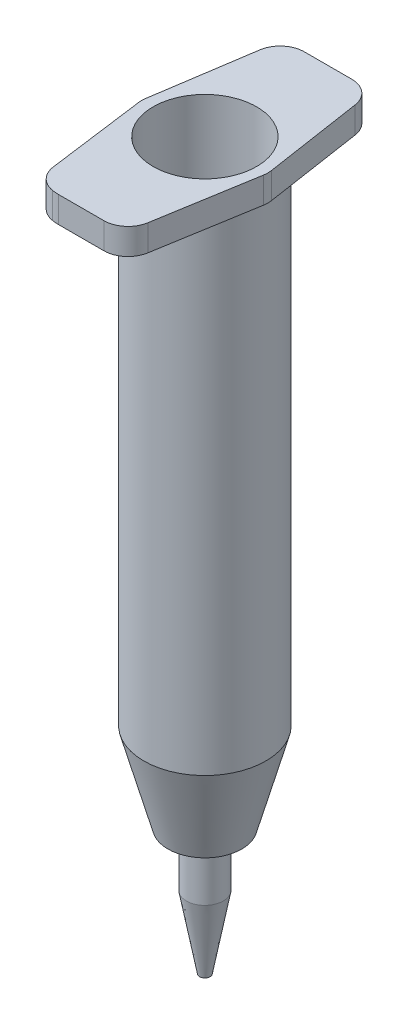
ISO-10303-21;
HEADER;
FILE_DESCRIPTION(('STEP AP214'),'2;1');
FILE_NAME('part.step','',(''),(''),'','','');
FILE_SCHEMA(('AUTOMOTIVE_DESIGN { 1 0 10303 214 1 1 1 1 }'));
ENDSEC;
DATA;
#1=APPLICATION_CONTEXT('core data for automotive mechanical design processes');
#2=APPLICATION_PROTOCOL_DEFINITION('international standard','automotive_design',2000,#1);
#3=PRODUCT_CONTEXT('',#1,'mechanical');
#4=PRODUCT('Part','Part','',(#3));
#5=PRODUCT_RELATED_PRODUCT_CATEGORY('part','',(#4));
#6=PRODUCT_DEFINITION_FORMATION('','',#4);
#7=PRODUCT_DEFINITION_CONTEXT('part definition',#1,'design');
#8=PRODUCT_DEFINITION('design','',#6,#7);
#9=PRODUCT_DEFINITION_SHAPE('','',#8);
#10=(LENGTH_UNIT() NAMED_UNIT(*) SI_UNIT(.MILLI.,.METRE.));
#11=(NAMED_UNIT(*) PLANE_ANGLE_UNIT() SI_UNIT($,.RADIAN.));
#12=(NAMED_UNIT(*) SI_UNIT($,.STERADIAN.) SOLID_ANGLE_UNIT());
#13=UNCERTAINTY_MEASURE_WITH_UNIT(LENGTH_MEASURE(1.E-05),#10,'distance_accuracy_value','');
#14=(GEOMETRIC_REPRESENTATION_CONTEXT(3) GLOBAL_UNCERTAINTY_ASSIGNED_CONTEXT((#13)) GLOBAL_UNIT_ASSIGNED_CONTEXT((#10,
#11,#12)) REPRESENTATION_CONTEXT('',''));
#15=CARTESIAN_POINT('',(0.,0.,0.));
#16=DIRECTION('',(0.,0.,1.));
#17=DIRECTION('',(1.,0.,0.));
#18=AXIS2_PLACEMENT_3D('',#15,#16,#17);
#19=CARTESIAN_POINT('',(0.,1.,0.));
#20=DIRECTION('',(0.,-1.,0.));
#21=DIRECTION('',(0.,0.,-1.));
#22=AXIS2_PLACEMENT_3D('',#19,#20,#21);
#23=PLANE('',#22);
#24=CARTESIAN_POINT('',(0.,1.,0.));
#25=DIRECTION('',(0.,-1.,0.));
#26=DIRECTION('',(0.,0.,-1.));
#27=AXIS2_PLACEMENT_3D('',#24,#25,#26);
#28=CIRCLE('',#27,3.6);
#29=CARTESIAN_POINT('',(3.13402100081113,1.,1.77141535684739));
#30=VERTEX_POINT('',#29);
#31=EDGE_CURVE('E415',#30,#30,#28,.T.);
#32=ORIENTED_EDGE('',*,*,#31,.F.);
#33=EDGE_LOOP('',(#32));
#34=FACE_BOUND('',#33,.T.);
#35=CARTESIAN_POINT('',(0.,1.,0.));
#36=DIRECTION('',(0.,1.,0.));
#37=DIRECTION('',(0.,0.,1.));
#38=AXIS2_PLACEMENT_3D('',#35,#36,#37);
#39=CIRCLE('',#38,1.27);
#40=CARTESIAN_POINT('',(0.104415360248278,1.,-1.26570037234103));
#41=VERTEX_POINT('',#40);
#42=EDGE_CURVE('E583',#41,#41,#39,.T.);
#43=ORIENTED_EDGE('',*,*,#42,.F.);
#44=EDGE_LOOP('',(#43));
#45=FACE_BOUND('',#44,.T.);
#46=ADVANCED_FACE('F43',(#34,#45),#23,.F.);
#47=CARTESIAN_POINT('',(0.,74.55,0.));
#48=DIRECTION('',(0.,-1.,0.));
#49=DIRECTION('',(0.,0.,-1.));
#50=AXIS2_PLACEMENT_3D('',#47,#48,#49);
#51=PLANE('',#50);
#52=CARTESIAN_POINT('',(0.,74.55,0.));
#53=DIRECTION('',(0.,1.,0.));
#54=DIRECTION('',(0.,0.,1.));
#55=AXIS2_PLACEMENT_3D('',#52,#53,#54);
#56=CIRCLE('',#55,6.45);
#57=CARTESIAN_POINT('',(0.,74.55,6.45));
#58=VERTEX_POINT('',#57);
#59=EDGE_CURVE('E186',#58,#58,#56,.T.);
#60=ORIENTED_EDGE('',*,*,#59,.F.);
#61=EDGE_LOOP('',(#60));
#62=FACE_BOUND('',#61,.T.);
#63=DIRECTION('',(0.164427381847979,0.,-0.986389190988334));
#64=VECTOR('',#63,1.);
#65=CARTESIAN_POINT('',(7.66208863427662,74.55,1.2772414632392));
#66=LINE('',#65,#64);
#67=CARTESIAN_POINT('',(5.73407299388516,74.55,12.8432821455439));
#68=VERTEX_POINT('',#67);
#69=CARTESIAN_POINT('',(7.79635098347913,74.55,0.471810345127156));
#70=VERTEX_POINT('',#69);
#71=EDGE_CURVE('E442',#68,#70,#66,.T.);
#72=ORIENTED_EDGE('',*,*,#71,.T.);
#73=CARTESIAN_POINT('',(4.83718341051413,74.55,-0.0214718004167819));
#74=DIRECTION('',(0.,-1.,0.));
#75=DIRECTION('',(0.,0.,-1.));
#76=AXIS2_PLACEMENT_3D('',#73,#74,#75);
#77=CIRCLE('',#76,3.);
#78=CARTESIAN_POINT('',(7.80302817866241,74.55,-0.472874958632888));
#79=VERTEX_POINT('',#78);
#80=EDGE_CURVE('E256',#70,#79,#77,.F.);
#81=ORIENTED_EDGE('',*,*,#80,.T.);
#82=DIRECTION('',(0.150467719405369,0.,0.988614922716093));
#83=VECTOR('',#82,1.);
#84=CARTESIAN_POINT('',(7.69670579015846,74.55,-1.17144273323074));
#85=LINE('',#84,#83);
#86=CARTESIAN_POINT('',(5.92690152105113,74.55,-12.7995508592832));
#87=VERTEX_POINT('',#86);
#88=EDGE_CURVE('E434',#87,#79,#85,.T.);
#89=ORIENTED_EDGE('',*,*,#88,.F.);
#90=CARTESIAN_POINT('',(2.96105675290285,74.55,-12.3481477010671));
#91=DIRECTION('',(0.,-1.,0.));
#92=DIRECTION('',(0.,0.,-1.));
#93=AXIS2_PLACEMENT_3D('',#90,#91,#92);
#94=CIRCLE('',#93,3.);
#95=CARTESIAN_POINT('',(3.09014188225713,74.55,-15.3453692526678));
#96=VERTEX_POINT('',#95);
#97=EDGE_CURVE('E241',#87,#96,#94,.F.);
#98=ORIENTED_EDGE('',*,*,#97,.T.);
#99=CARTESIAN_POINT('',(2.875,74.55,-10.35));
#100=DIRECTION('',(0.,-1.,0.));
#101=DIRECTION('',(0.,0.,-1.));
#102=AXIS2_PLACEMENT_3D('',#99,#100,#101);
#103=CIRCLE('',#102,5.);
#104=CARTESIAN_POINT('',(2.875,74.55,-15.35));
#105=VERTEX_POINT('',#104);
#106=EDGE_CURVE('E160',#96,#105,#103,.F.);
#107=ORIENTED_EDGE('',*,*,#106,.T.);
#108=DIRECTION('',(-1.,0.,0.));
#109=VECTOR('',#108,1.);
#110=CARTESIAN_POINT('',(7.875,74.55,-15.35));
#111=LINE('',#110,#109);
#112=CARTESIAN_POINT('',(-2.875,74.55,-15.35));
#113=VERTEX_POINT('',#112);
#114=EDGE_CURVE('E178',#105,#113,#111,.T.);
#115=ORIENTED_EDGE('',*,*,#114,.T.);
#116=CARTESIAN_POINT('',(-2.875,74.55,-10.35));
#117=DIRECTION('',(0.,-1.,0.));
#118=DIRECTION('',(0.,0.,-1.));
#119=AXIS2_PLACEMENT_3D('',#116,#117,#118);
#120=CIRCLE('',#119,5.);
#121=CARTESIAN_POINT('',(-3.11575123219801,74.55,-15.3442005210239));
#122=VERTEX_POINT('',#121);
#123=EDGE_CURVE('E220',#113,#122,#120,.F.);
#124=ORIENTED_EDGE('',*,*,#123,.T.);
#125=CARTESIAN_POINT('',(-2.9713004928792,74.55,-12.3476802084095));
#126=DIRECTION('',(0.,-1.,0.));
#127=DIRECTION('',(0.,0.,-1.));
#128=AXIS2_PLACEMENT_3D('',#125,#126,#127);
#129=CIRCLE('',#128,3.);
#130=CARTESIAN_POINT('',(-5.93749508686239,74.55,-12.7967788953648));
#131=VERTEX_POINT('',#130);
#132=EDGE_CURVE('E250',#122,#131,#129,.F.);
#133=ORIENTED_EDGE('',*,*,#132,.T.);
#134=DIRECTION('',(-0.149699562318408,0.,0.98873153132773));
#135=VECTOR('',#134,1.);
#136=CARTESIAN_POINT('',(-7.69852157320321,74.55,-1.16559983523509));
#137=LINE('',#136,#135);
#138=CARTESIAN_POINT('',(-7.8109780399289,74.55,-0.422850472234944));
#139=VERTEX_POINT('',#138);
#140=EDGE_CURVE('E424',#131,#139,#137,.T.);
#141=ORIENTED_EDGE('',*,*,#140,.T.);
#142=CARTESIAN_POINT('',(-4.84478344594571,74.55,0.0262482147202797));
#143=DIRECTION('',(0.,-1.,0.));
#144=DIRECTION('',(0.,0.,-1.));
#145=AXIS2_PLACEMENT_3D('',#142,#143,#144);
#146=CIRCLE('',#145,3.);
#147=CARTESIAN_POINT('',(-7.81831269235019,74.55,0.423896074990171));
#148=VERTEX_POINT('',#147);
#149=EDGE_CURVE('E253',#139,#148,#146,.F.);
#150=ORIENTED_EDGE('',*,*,#149,.T.);
#151=DIRECTION('',(-0.132549286756631,0.,-0.991176415468159));
#152=VECTOR('',#151,1.);
#153=CARTESIAN_POINT('',(-7.73664165681993,74.55,1.03461534949735));
#154=LINE('',#153,#152);
#155=CARTESIAN_POINT('',(-6.1738280043085,74.55,12.7210157221006));
#156=VERTEX_POINT('',#155);
#157=EDGE_CURVE('E443',#156,#148,#154,.T.);
#158=ORIENTED_EDGE('',*,*,#157,.F.);
#159=CARTESIAN_POINT('',(-3.20029875790403,74.55,12.3233678618307));
#160=DIRECTION('',(0.,-1.,0.));
#161=DIRECTION('',(0.,0.,-1.));
#162=AXIS2_PLACEMENT_3D('',#159,#160,#161);
#163=CIRCLE('',#162,3.);
#164=CARTESIAN_POINT('',(-3.68824689476008,74.55,15.2834196545766));
#165=VERTEX_POINT('',#164);
#166=EDGE_CURVE('E247',#156,#165,#163,.F.);
#167=ORIENTED_EDGE('',*,*,#166,.T.);
#168=CARTESIAN_POINT('',(-2.875,74.55,10.35));
#169=DIRECTION('',(0.,-1.,0.));
#170=DIRECTION('',(0.,0.,-1.));
#171=AXIS2_PLACEMENT_3D('',#168,#169,#170);
#172=CIRCLE('',#171,5.);
#173=CARTESIAN_POINT('',(-2.875,74.55,15.35));
#174=VERTEX_POINT('',#173);
#175=EDGE_CURVE('E224',#165,#174,#172,.F.);
#176=ORIENTED_EDGE('',*,*,#175,.T.);
#177=DIRECTION('',(1.,0.,0.));
#178=VECTOR('',#177,1.);
#179=CARTESIAN_POINT('',(7.875,74.55,15.35));
#180=LINE('',#179,#178);
#181=CARTESIAN_POINT('',(2.77490542092016,74.55,15.35));
#182=VERTEX_POINT('',#181);
#183=EDGE_CURVE('E170',#174,#182,#180,.T.);
#184=ORIENTED_EDGE('',*,*,#183,.T.);
#185=CARTESIAN_POINT('',(2.77490542092016,74.55,12.35));
#186=DIRECTION('',(0.,-1.,0.));
#187=DIRECTION('',(0.,0.,-1.));
#188=AXIS2_PLACEMENT_3D('',#185,#186,#187);
#189=CIRCLE('',#188,3.);
#190=EDGE_CURVE('E244',#182,#68,#189,.F.);
#191=ORIENTED_EDGE('',*,*,#190,.T.);
#192=EDGE_LOOP('',(#72,#81,#89,#98,#107,#115,#124,#133,#141,#150,#158,#167,#176,#184,#191));
#193=FACE_BOUND('',#192,.T.);
#194=ADVANCED_FACE('F324',(#62,#193),#51,.F.);
#195=CARTESIAN_POINT('',(0.,71.3,0.));
#196=DIRECTION('',(0.,-1.,0.));
#197=DIRECTION('',(0.,0.,-1.));
#198=AXIS2_PLACEMENT_3D('',#195,#196,#197);
#199=PLANE('',#198);
#200=CARTESIAN_POINT('',(0.,71.3,0.));
#201=DIRECTION('',(0.,1.,0.));
#202=DIRECTION('',(0.,0.,1.));
#203=AXIS2_PLACEMENT_3D('',#200,#201,#202);
#204=CIRCLE('',#203,7.6);
#205=CARTESIAN_POINT('',(0.,71.3,7.6));
#206=VERTEX_POINT('',#205);
#207=EDGE_CURVE('E196',#206,#206,#204,.T.);
#208=ORIENTED_EDGE('',*,*,#207,.T.);
#209=EDGE_LOOP('',(#208));
#210=FACE_BOUND('',#209,.T.);
#211=DIRECTION('',(-0.150467719405369,0.,-0.988614922716093));
#212=VECTOR('',#211,1.);
#213=CARTESIAN_POINT('',(7.69670579015846,71.3,-1.17144273323074));
#214=LINE('',#213,#212);
#215=CARTESIAN_POINT('',(7.80302817866241,71.3,-0.472874958632888));
#216=VERTEX_POINT('',#215);
#217=CARTESIAN_POINT('',(5.92690152105113,71.3,-12.7995508592832));
#218=VERTEX_POINT('',#217);
#219=EDGE_CURVE('E438',#216,#218,#214,.T.);
#220=ORIENTED_EDGE('',*,*,#219,.F.);
#221=CARTESIAN_POINT('',(4.83718341051413,71.3,-0.0214718004167819));
#222=DIRECTION('',(0.,-1.,0.));
#223=DIRECTION('',(0.,0.,-1.));
#224=AXIS2_PLACEMENT_3D('',#221,#222,#223);
#225=CIRCLE('',#224,3.);
#226=CARTESIAN_POINT('',(7.79635098347913,71.3,0.471810345127156));
#227=VERTEX_POINT('',#226);
#228=EDGE_CURVE('E280',#216,#227,#225,.T.);
#229=ORIENTED_EDGE('',*,*,#228,.T.);
#230=DIRECTION('',(-0.164427381847979,0.,0.986389190988333));
#231=VECTOR('',#230,1.);
#232=CARTESIAN_POINT('',(7.66208863427662,71.3,1.2772414632392));
#233=LINE('',#232,#231);
#234=CARTESIAN_POINT('',(5.73407299388516,71.3,12.8432821455439));
#235=VERTEX_POINT('',#234);
#236=EDGE_CURVE('E447',#227,#235,#233,.T.);
#237=ORIENTED_EDGE('',*,*,#236,.T.);
#238=CARTESIAN_POINT('',(2.77490542092016,71.3,12.35));
#239=DIRECTION('',(0.,-1.,0.));
#240=DIRECTION('',(0.,0.,-1.));
#241=AXIS2_PLACEMENT_3D('',#238,#239,#240);
#242=CIRCLE('',#241,3.);
#243=CARTESIAN_POINT('',(2.77490542092016,71.3,15.35));
#244=VERTEX_POINT('',#243);
#245=EDGE_CURVE('E70',#235,#244,#242,.T.);
#246=ORIENTED_EDGE('',*,*,#245,.T.);
#247=DIRECTION('',(1.,0.,0.));
#248=VECTOR('',#247,1.);
#249=CARTESIAN_POINT('',(7.875,71.3,15.35));
#250=LINE('',#249,#248);
#251=CARTESIAN_POINT('',(-2.875,71.3,15.35));
#252=VERTEX_POINT('',#251);
#253=EDGE_CURVE('E167',#252,#244,#250,.T.);
#254=ORIENTED_EDGE('',*,*,#253,.F.);
#255=CARTESIAN_POINT('',(-2.875,71.3,10.35));
#256=DIRECTION('',(0.,-1.,0.));
#257=DIRECTION('',(0.,0.,-1.));
#258=AXIS2_PLACEMENT_3D('',#255,#256,#257);
#259=CIRCLE('',#258,5.);
#260=CARTESIAN_POINT('',(-3.68824689476008,71.3,15.2834196545766));
#261=VERTEX_POINT('',#260);
#262=EDGE_CURVE('E154',#252,#261,#259,.T.);
#263=ORIENTED_EDGE('',*,*,#262,.T.);
#264=CARTESIAN_POINT('',(-3.20029875790403,71.3,12.3233678618307));
#265=DIRECTION('',(0.,-1.,0.));
#266=DIRECTION('',(0.,0.,-1.));
#267=AXIS2_PLACEMENT_3D('',#264,#265,#266);
#268=CIRCLE('',#267,3.);
#269=CARTESIAN_POINT('',(-6.1738280043085,71.3,12.7210157221006));
#270=VERTEX_POINT('',#269);
#271=EDGE_CURVE('E271',#261,#270,#268,.T.);
#272=ORIENTED_EDGE('',*,*,#271,.T.);
#273=DIRECTION('',(0.132549286756631,0.,0.991176415468159));
#274=VECTOR('',#273,1.);
#275=CARTESIAN_POINT('',(-7.73664165681993,71.3,1.03461534949735));
#276=LINE('',#275,#274);
#277=CARTESIAN_POINT('',(-7.81831269235019,71.3,0.423896074990171));
#278=VERTEX_POINT('',#277);
#279=EDGE_CURVE('E453',#278,#270,#276,.T.);
#280=ORIENTED_EDGE('',*,*,#279,.F.);
#281=CARTESIAN_POINT('',(-4.84478344594571,71.3,0.0262482147202797));
#282=DIRECTION('',(0.,-1.,0.));
#283=DIRECTION('',(0.,0.,-1.));
#284=AXIS2_PLACEMENT_3D('',#281,#282,#283);
#285=CIRCLE('',#284,3.);
#286=CARTESIAN_POINT('',(-7.8109780399289,71.3,-0.422850472234944));
#287=VERTEX_POINT('',#286);
#288=EDGE_CURVE('E277',#278,#287,#285,.T.);
#289=ORIENTED_EDGE('',*,*,#288,.T.);
#290=DIRECTION('',(0.149699562318408,0.,-0.98873153132773));
#291=VECTOR('',#290,1.);
#292=CARTESIAN_POINT('',(-7.69852157320321,71.3,-1.16559983523509));
#293=LINE('',#292,#291);
#294=CARTESIAN_POINT('',(-5.93749508686239,71.3,-12.7967788953648));
#295=VERTEX_POINT('',#294);
#296=EDGE_CURVE('E430',#287,#295,#293,.T.);
#297=ORIENTED_EDGE('',*,*,#296,.T.);
#298=CARTESIAN_POINT('',(-2.9713004928792,71.3,-12.3476802084095));
#299=DIRECTION('',(0.,-1.,0.));
#300=DIRECTION('',(0.,0.,-1.));
#301=AXIS2_PLACEMENT_3D('',#298,#299,#300);
#302=CIRCLE('',#301,3.);
#303=CARTESIAN_POINT('',(-3.11575123219801,71.3,-15.3442005210239));
#304=VERTEX_POINT('',#303);
#305=EDGE_CURVE('E274',#295,#304,#302,.T.);
#306=ORIENTED_EDGE('',*,*,#305,.T.);
#307=CARTESIAN_POINT('',(-2.875,71.3,-10.35));
#308=DIRECTION('',(0.,-1.,0.));
#309=DIRECTION('',(0.,0.,-1.));
#310=AXIS2_PLACEMENT_3D('',#307,#308,#309);
#311=CIRCLE('',#310,5.);
#312=CARTESIAN_POINT('',(-2.875,71.3,-15.35));
#313=VERTEX_POINT('',#312);
#314=EDGE_CURVE('E161',#304,#313,#311,.T.);
#315=ORIENTED_EDGE('',*,*,#314,.T.);
#316=DIRECTION('',(-1.,0.,0.));
#317=VECTOR('',#316,1.);
#318=CARTESIAN_POINT('',(7.875,71.3,-15.35));
#319=LINE('',#318,#317);
#320=CARTESIAN_POINT('',(2.875,71.3,-15.35));
#321=VERTEX_POINT('',#320);
#322=EDGE_CURVE('E179',#321,#313,#319,.T.);
#323=ORIENTED_EDGE('',*,*,#322,.F.);
#324=CARTESIAN_POINT('',(2.875,71.3,-10.35));
#325=DIRECTION('',(0.,-1.,0.));
#326=DIRECTION('',(0.,0.,-1.));
#327=AXIS2_PLACEMENT_3D('',#324,#325,#326);
#328=CIRCLE('',#327,5.);
#329=CARTESIAN_POINT('',(3.09014188225713,71.3,-15.3453692526678));
#330=VERTEX_POINT('',#329);
#331=EDGE_CURVE('E172',#321,#330,#328,.T.);
#332=ORIENTED_EDGE('',*,*,#331,.T.);
#333=CARTESIAN_POINT('',(2.96105675290285,71.3,-12.3481477010671));
#334=DIRECTION('',(0.,-1.,0.));
#335=DIRECTION('',(0.,0.,-1.));
#336=AXIS2_PLACEMENT_3D('',#333,#334,#335);
#337=CIRCLE('',#336,3.);
#338=EDGE_CURVE('E266',#330,#218,#337,.T.);
#339=ORIENTED_EDGE('',*,*,#338,.T.);
#340=EDGE_LOOP('',(#220,#229,#237,#246,#254,#263,#272,#280,#289,#297,#306,#315,#323,#332,#339));
#341=FACE_BOUND('',#340,.T.);
#342=ADVANCED_FACE('F176',(#210,#341),#199,.T.);
#343=CARTESIAN_POINT('',(-2.875,74.55,-10.35));
#344=DIRECTION('',(0.,-1.,0.));
#345=DIRECTION('',(0.,0.,-1.));
#346=AXIS2_PLACEMENT_3D('',#343,#344,#345);
#347=CYLINDRICAL_SURFACE('',#346,5.);
#348=ORIENTED_EDGE('',*,*,#314,.F.);
#349=DIRECTION('',(0.,-1.,0.));
#350=VECTOR('',#349,1.);
#351=CARTESIAN_POINT('',(-3.11575123219801,74.55,-15.3442005210239));
#352=LINE('',#351,#350);
#353=EDGE_CURVE('E297',#304,#122,#352,.F.);
#354=ORIENTED_EDGE('',*,*,#353,.T.);
#355=ORIENTED_EDGE('',*,*,#123,.F.);
#356=DIRECTION('',(0.,-1.,0.));
#357=VECTOR('',#356,1.);
#358=CARTESIAN_POINT('',(-2.875,74.55,-15.35));
#359=LINE('',#358,#357);
#360=EDGE_CURVE('E231',#313,#113,#359,.F.);
#361=ORIENTED_EDGE('',*,*,#360,.F.);
#362=EDGE_LOOP('',(#348,#354,#355,#361));
#363=FACE_BOUND('',#362,.T.);
#364=ADVANCED_FACE('F330',(#363),#347,.T.);
#365=CARTESIAN_POINT('',(0.,71.3,0.));
#366=DIRECTION('',(0.,-1.,0.));
#367=DIRECTION('',(0.,0.,-1.));
#368=AXIS2_PLACEMENT_3D('',#365,#366,#367);
#369=CYLINDRICAL_SURFACE('',#368,7.6);
#370=CARTESIAN_POINT('',(0.,11.,0.));
#371=DIRECTION('',(0.,1.,0.));
#372=DIRECTION('',(0.,0.,1.));
#373=AXIS2_PLACEMENT_3D('',#370,#371,#372);
#374=CIRCLE('',#373,7.6);
#375=CARTESIAN_POINT('',(0.,11.,7.6));
#376=VERTEX_POINT('',#375);
#377=EDGE_CURVE('E200',#376,#376,#374,.T.);
#378=ORIENTED_EDGE('',*,*,#377,.T.);
#379=EDGE_LOOP('',(#378));
#380=FACE_BOUND('',#379,.T.);
#381=ORIENTED_EDGE('',*,*,#207,.F.);
#382=EDGE_LOOP('',(#381));
#383=FACE_BOUND('',#382,.T.);
#384=ADVANCED_FACE('F351',(#380,#383),#369,.T.);
#385=CARTESIAN_POINT('',(0.,0.,0.));
#386=DIRECTION('',(0.,1.,0.));
#387=DIRECTION('',(0.,0.,1.));
#388=AXIS2_PLACEMENT_3D('',#385,#386,#387);
#389=PLANE('',#388);
#390=CARTESIAN_POINT('',(0.,0.,0.));
#391=DIRECTION('',(0.,-1.,0.));
#392=DIRECTION('',(0.,0.,-1.));
#393=AXIS2_PLACEMENT_3D('',#390,#391,#392);
#394=CIRCLE('',#393,2.3);
#395=CARTESIAN_POINT('',(0.,0.,-2.3));
#396=VERTEX_POINT('',#395);
#397=EDGE_CURVE('E190',#396,#396,#394,.T.);
#398=ORIENTED_EDGE('',*,*,#397,.F.);
#399=EDGE_LOOP('',(#398));
#400=FACE_BOUND('',#399,.T.);
#401=CARTESIAN_POINT('',(0.,0.,0.));
#402=DIRECTION('',(0.,1.,0.));
#403=DIRECTION('',(0.,0.,1.));
#404=AXIS2_PLACEMENT_3D('',#401,#402,#403);
#405=CIRCLE('',#404,4.60000000000004);
#406=CARTESIAN_POINT('',(0.,0.,4.60000000000004));
#407=VERTEX_POINT('',#406);
#408=EDGE_CURVE('E195',#407,#407,#405,.F.);
#409=ORIENTED_EDGE('',*,*,#408,.T.);
#410=EDGE_LOOP('',(#409));
#411=FACE_BOUND('',#410,.T.);
#412=ADVANCED_FACE('F348',(#400,#411),#389,.F.);
#413=CARTESIAN_POINT('',(0.,11.,0.));
#414=DIRECTION('',(0.,1.,0.));
#415=DIRECTION('',(0.,0.,1.));
#416=AXIS2_PLACEMENT_3D('',#413,#414,#415);
#417=CONICAL_SURFACE('',#416,7.6,0.266252049150922);
#418=ORIENTED_EDGE('',*,*,#408,.F.);
#419=EDGE_LOOP('',(#418));
#420=FACE_BOUND('',#419,.T.);
#421=ORIENTED_EDGE('',*,*,#377,.F.);
#422=EDGE_LOOP('',(#421));
#423=FACE_BOUND('',#422,.T.);
#424=ADVANCED_FACE('F346',(#420,#423),#417,.T.);
#425=CARTESIAN_POINT('',(0.,-15.75,0.));
#426=DIRECTION('',(0.,1.,0.));
#427=DIRECTION('',(0.,0.,1.));
#428=AXIS2_PLACEMENT_3D('',#425,#426,#427);
#429=CYLINDRICAL_SURFACE('',#428,2.3);
#430=CARTESIAN_POINT('',(0.,-6.74999999999979,0.));
#431=DIRECTION('',(0.,-1.,0.));
#432=DIRECTION('',(0.,0.,-1.));
#433=AXIS2_PLACEMENT_3D('',#430,#431,#432);
#434=CIRCLE('',#433,2.3);
#435=CARTESIAN_POINT('',(0.,-6.74999999999979,2.3));
#436=VERTEX_POINT('',#435);
#437=EDGE_CURVE('E173',#436,#436,#434,.F.);
#438=ORIENTED_EDGE('',*,*,#437,.T.);
#439=EDGE_LOOP('',(#438));
#440=FACE_BOUND('',#439,.T.);
#441=ORIENTED_EDGE('',*,*,#397,.T.);
#442=EDGE_LOOP('',(#441));
#443=FACE_BOUND('',#442,.T.);
#444=ADVANCED_FACE('F342',(#440,#443),#429,.T.);
#445=CARTESIAN_POINT('',(0.,-15.75,0.));
#446=DIRECTION('',(0.,-1.,0.));
#447=DIRECTION('',(0.,0.,-1.));
#448=AXIS2_PLACEMENT_3D('',#445,#446,#447);
#449=PLANE('',#448);
#450=CARTESIAN_POINT('',(0.,-15.75,0.));
#451=DIRECTION('',(0.,-1.,0.));
#452=DIRECTION('',(0.,0.,-1.));
#453=AXIS2_PLACEMENT_3D('',#450,#451,#452);
#454=CIRCLE('',#453,0.25);
#455=CARTESIAN_POINT('',(0.160322235702025,-15.75,-0.191824869971296));
#456=VERTEX_POINT('',#455);
#457=EDGE_CURVE('E580',#456,#456,#454,.T.);
#458=ORIENTED_EDGE('',*,*,#457,.F.);
#459=EDGE_LOOP('',(#458));
#460=FACE_BOUND('',#459,.T.);
#461=CARTESIAN_POINT('',(0.,-15.75,0.));
#462=DIRECTION('',(0.,-1.,0.));
#463=DIRECTION('',(0.,0.,-1.));
#464=AXIS2_PLACEMENT_3D('',#461,#462,#463);
#465=CIRCLE('',#464,0.649999999999991);
#466=CARTESIAN_POINT('',(0.,-15.75,0.649999999999991));
#467=VERTEX_POINT('',#466);
#468=EDGE_CURVE('E194',#467,#467,#465,.T.);
#469=ORIENTED_EDGE('',*,*,#468,.T.);
#470=EDGE_LOOP('',(#469));
#471=FACE_BOUND('',#470,.T.);
#472=ADVANCED_FACE('F339',(#460,#471),#449,.T.);
#473=CARTESIAN_POINT('',(0.,-15.75,0.));
#474=DIRECTION('',(0.,1.,0.));
#475=DIRECTION('',(0.,0.,1.));
#476=AXIS2_PLACEMENT_3D('',#473,#474,#475);
#477=CONICAL_SURFACE('',#476,0.649999999999991,0.181319774401487);
#478=CARTESIAN_POINT('',(0.,-6.74999999999979,2.3));
#479=CARTESIAN_POINT('',(0.,-6.84374999999979,2.2828125));
#480=CARTESIAN_POINT('',(0.,-6.93749999999979,2.265625));
#481=CARTESIAN_POINT('',(0.,-7.1249999999998,2.23125));
#482=CARTESIAN_POINT('',(0.,-7.2187499999998,2.2140625));
#483=CARTESIAN_POINT('',(0.,-7.4062499999998,2.1796875));
#484=CARTESIAN_POINT('',(0.,-7.4999999999998,2.1625));
#485=CARTESIAN_POINT('',(0.,-7.68749999999981,2.128125));
#486=CARTESIAN_POINT('',(0.,-7.78124999999981,2.1109375));
#487=CARTESIAN_POINT('',(0.,-7.96874999999982,2.0765625));
#488=CARTESIAN_POINT('',(0.,-8.06249999999982,2.059375));
#489=CARTESIAN_POINT('',(0.,-8.24999999999982,2.025));
#490=CARTESIAN_POINT('',(0.,-8.34374999999983,2.0078125));
#491=CARTESIAN_POINT('',(0.,-8.53124999999983,1.9734375));
#492=CARTESIAN_POINT('',(0.,-8.62499999999983,1.95625));
#493=CARTESIAN_POINT('',(0.,-8.81249999999984,1.921875));
#494=CARTESIAN_POINT('',(0.,-8.90624999999984,1.9046875));
#495=CARTESIAN_POINT('',(0.,-9.09374999999984,1.8703125));
#496=CARTESIAN_POINT('',(0.,-9.18749999999985,1.853125));
#497=CARTESIAN_POINT('',(0.,-9.37499999999985,1.81875));
#498=CARTESIAN_POINT('',(0.,-9.46874999999985,1.8015625));
#499=CARTESIAN_POINT('',(0.,-9.65624999999985,1.7671875));
#500=CARTESIAN_POINT('',(0.,-9.74999999999986,1.75));
#501=CARTESIAN_POINT('',(0.,-9.93749999999986,1.715625));
#502=CARTESIAN_POINT('',(0.,-10.0312499999999,1.6984375));
#503=CARTESIAN_POINT('',(0.,-10.2187499999999,1.6640625));
#504=CARTESIAN_POINT('',(0.,-10.3124999999999,1.646875));
#505=CARTESIAN_POINT('',(0.,-10.4999999999999,1.6125));
#506=CARTESIAN_POINT('',(0.,-10.5937499999999,1.5953125));
#507=CARTESIAN_POINT('',(0.,-10.7812499999999,1.5609375));
#508=CARTESIAN_POINT('',(0.,-10.8749999999999,1.54375));
#509=CARTESIAN_POINT('',(0.,-11.0624999999999,1.509375));
#510=CARTESIAN_POINT('',(0.,-11.1562499999999,1.4921875));
#511=CARTESIAN_POINT('',(0.,-11.3437499999999,1.4578125));
#512=CARTESIAN_POINT('',(0.,-11.4374999999999,1.440625));
#513=CARTESIAN_POINT('',(0.,-11.6249999999999,1.40625));
#514=CARTESIAN_POINT('',(0.,-11.7187499999999,1.38906249999999));
#515=CARTESIAN_POINT('',(0.,-11.9062499999999,1.35468749999999));
#516=CARTESIAN_POINT('',(0.,-11.9999999999999,1.33749999999999));
#517=CARTESIAN_POINT('',(0.,-12.1874999999999,1.30312499999999));
#518=CARTESIAN_POINT('',(0.,-12.2812499999999,1.28593749999999));
#519=CARTESIAN_POINT('',(0.,-12.4687499999999,1.25156249999999));
#520=CARTESIAN_POINT('',(0.,-12.5624999999999,1.23437499999999));
#521=CARTESIAN_POINT('',(0.,-12.7499999999999,1.19999999999999));
#522=CARTESIAN_POINT('',(0.,-12.8437499999999,1.18281249999999));
#523=CARTESIAN_POINT('',(0.,-13.0312499999999,1.14843749999999));
#524=CARTESIAN_POINT('',(0.,-13.1249999999999,1.13124999999999));
#525=CARTESIAN_POINT('',(0.,-13.3124999999999,1.09687499999999));
#526=CARTESIAN_POINT('',(0.,-13.4062499999999,1.07968749999999));
#527=CARTESIAN_POINT('',(0.,-13.5937499999999,1.04531249999999));
#528=CARTESIAN_POINT('',(0.,-13.6875,1.02812499999999));
#529=CARTESIAN_POINT('',(0.,-13.875,0.993749999999993));
#530=CARTESIAN_POINT('',(0.,-13.96875,0.976562499999993));
#531=CARTESIAN_POINT('',(0.,-14.15625,0.942187499999993));
#532=CARTESIAN_POINT('',(0.,-14.25,0.924999999999993));
#533=CARTESIAN_POINT('',(0.,-14.4375,0.890624999999993));
#534=CARTESIAN_POINT('',(0.,-14.53125,0.873437499999993));
#535=CARTESIAN_POINT('',(0.,-14.71875,0.839062499999992));
#536=CARTESIAN_POINT('',(0.,-14.8125,0.821874999999992));
#537=CARTESIAN_POINT('',(0.,-15.,0.787499999999992));
#538=CARTESIAN_POINT('',(0.,-15.09375,0.770312499999992));
#539=CARTESIAN_POINT('',(0.,-15.28125,0.735937499999992));
#540=CARTESIAN_POINT('',(0.,-15.375,0.718749999999992));
#541=CARTESIAN_POINT('',(0.,-15.5625,0.684374999999991));
#542=CARTESIAN_POINT('',(0.,-15.65625,0.667187499999991));
#543=CARTESIAN_POINT('',(0.,-15.75,0.649999999999991));
#544=B_SPLINE_CURVE_WITH_KNOTS('',3,(#478,#479,#480,#481,#482,#483,#484,#485,#486,#487,#488,
#489,#490,#491,#492,#493,#494,#495,#496,#497,#498,#499,#500,#501,#502,#503,#504,#505,#506,#507,
#508,#509,#510,#511,#512,#513,#514,#515,#516,#517,#518,#519,#520,#521,#522,#523,#524,#525,#526,
#527,#528,#529,#530,#531,#532,#533,#534,#535,#536,#537,#538,#539,#540,#541,#542,#543),
.UNSPECIFIED.,.F.,.F.,(4,2,2,2,2,2,2,2,2,2,2,2,2,2,2,2,2,2,2,2,2,2,2,2,2,2,2,2,2,2,2,2,4),(0.,
0.285937500000007,0.571875000000013,0.85781250000002,1.14375000000003,1.42968750000003,
1.71562500000004,2.00156250000005,2.28750000000005,2.57343750000006,2.85937500000006,
3.14531250000007,3.43125000000008,3.71718750000009,4.00312500000009,4.2890625000001,
4.5750000000001,4.86093750000011,5.14687500000012,5.43281250000013,5.71875000000013,
6.00468750000014,6.29062500000015,6.57656250000015,6.86250000000016,7.14843750000017,
7.43437500000017,7.72031250000018,8.00625000000018,8.29218750000019,8.5781250000002,
8.8640625000002,9.15000000000021),.UNSPECIFIED.);
#545=EDGE_CURVE('BSEAM337',#436,#467,#544,.T.);
#546=ORIENTED_EDGE('',*,*,#437,.F.);
#547=ORIENTED_EDGE('',*,*,#468,.F.);
#548=ORIENTED_EDGE('',*,*,#545,.T.);
#549=ORIENTED_EDGE('',*,*,#545,.F.);
#550=EDGE_LOOP('',(#546,#548,#547,#549));
#551=FACE_BOUND('',#550,.T.);
#552=ADVANCED_FACE('F337',(#551),#477,.T.);
#553=CARTESIAN_POINT('',(7.875,74.55,-15.35));
#554=DIRECTION('',(0.,0.,1.));
#555=DIRECTION('',(1.,0.,0.));
#556=AXIS2_PLACEMENT_3D('',#553,#554,#555);
#557=PLANE('',#556);
#558=ORIENTED_EDGE('',*,*,#322,.T.);
#559=ORIENTED_EDGE('',*,*,#360,.T.);
#560=ORIENTED_EDGE('',*,*,#114,.F.);
#561=DIRECTION('',(0.,-1.,0.));
#562=VECTOR('',#561,1.);
#563=CARTESIAN_POINT('',(2.875,74.55,-15.35));
#564=LINE('',#563,#562);
#565=EDGE_CURVE('E227',#105,#321,#564,.T.);
#566=ORIENTED_EDGE('',*,*,#565,.T.);
#567=EDGE_LOOP('',(#558,#559,#560,#566));
#568=FACE_BOUND('',#567,.T.);
#569=ADVANCED_FACE('F334',(#568),#557,.F.);
#570=CARTESIAN_POINT('',(7.875,74.55,15.35));
#571=DIRECTION('',(0.,0.,-1.));
#572=DIRECTION('',(-1.,0.,0.));
#573=AXIS2_PLACEMENT_3D('',#570,#571,#572);
#574=PLANE('',#573);
#575=ORIENTED_EDGE('',*,*,#253,.T.);
#576=DIRECTION('',(0.,1.,0.));
#577=VECTOR('',#576,1.);
#578=CARTESIAN_POINT('',(2.77490542092016,74.55,15.35));
#579=LINE('',#578,#577);
#580=EDGE_CURVE('E54',#244,#182,#579,.T.);
#581=ORIENTED_EDGE('',*,*,#580,.T.);
#582=ORIENTED_EDGE('',*,*,#183,.F.);
#583=DIRECTION('',(0.,-1.,0.));
#584=VECTOR('',#583,1.);
#585=CARTESIAN_POINT('',(-2.875,74.55,15.35));
#586=LINE('',#585,#584);
#587=EDGE_CURVE('E157',#174,#252,#586,.T.);
#588=ORIENTED_EDGE('',*,*,#587,.T.);
#589=EDGE_LOOP('',(#575,#581,#582,#588));
#590=FACE_BOUND('',#589,.T.);
#591=ADVANCED_FACE('F165',(#590),#574,.F.);
#592=CARTESIAN_POINT('',(-2.875,74.55,10.35));
#593=DIRECTION('',(0.,-1.,0.));
#594=DIRECTION('',(0.,0.,-1.));
#595=AXIS2_PLACEMENT_3D('',#592,#593,#594);
#596=CYLINDRICAL_SURFACE('',#595,5.);
#597=ORIENTED_EDGE('',*,*,#175,.F.);
#598=DIRECTION('',(0.,-1.,0.));
#599=VECTOR('',#598,1.);
#600=CARTESIAN_POINT('',(-3.68824689476008,74.55,15.2834196545766));
#601=LINE('',#600,#599);
#602=EDGE_CURVE('E62',#165,#261,#601,.T.);
#603=ORIENTED_EDGE('',*,*,#602,.T.);
#604=ORIENTED_EDGE('',*,*,#262,.F.);
#605=ORIENTED_EDGE('',*,*,#587,.F.);
#606=EDGE_LOOP('',(#597,#603,#604,#605));
#607=FACE_BOUND('',#606,.T.);
#608=ADVANCED_FACE('F156',(#607),#596,.T.);
#609=CARTESIAN_POINT('',(2.875,74.55,-10.35));
#610=DIRECTION('',(0.,-1.,0.));
#611=DIRECTION('',(0.,0.,-1.));
#612=AXIS2_PLACEMENT_3D('',#609,#610,#611);
#613=CYLINDRICAL_SURFACE('',#612,5.);
#614=ORIENTED_EDGE('',*,*,#106,.F.);
#615=DIRECTION('',(0.,-1.,0.));
#616=VECTOR('',#615,1.);
#617=CARTESIAN_POINT('',(3.09014188225713,74.55,-15.3453692526678));
#618=LINE('',#617,#616);
#619=EDGE_CURVE('E12',#96,#330,#618,.T.);
#620=ORIENTED_EDGE('',*,*,#619,.T.);
#621=ORIENTED_EDGE('',*,*,#331,.F.);
#622=ORIENTED_EDGE('',*,*,#565,.F.);
#623=EDGE_LOOP('',(#614,#620,#621,#622));
#624=FACE_BOUND('',#623,.T.);
#625=ADVANCED_FACE('F322',(#624),#613,.T.);
#626=CARTESIAN_POINT('',(0.,11.05,0.));
#627=DIRECTION('',(0.,1.,0.));
#628=DIRECTION('',(0.,0.,1.));
#629=AXIS2_PLACEMENT_3D('',#626,#627,#628);
#630=CYLINDRICAL_SURFACE('',#629,6.45);
#631=CARTESIAN_POINT('',(0.,11.05,0.));
#632=DIRECTION('',(0.,1.,0.));
#633=DIRECTION('',(0.,0.,1.));
#634=AXIS2_PLACEMENT_3D('',#631,#632,#633);
#635=CIRCLE('',#634,6.45);
#636=CARTESIAN_POINT('',(6.27741784559687,11.05,1.48206787691454));
#637=VERTEX_POINT('',#636);
#638=EDGE_CURVE('E47',#637,#637,#635,.T.);
#639=ORIENTED_EDGE('',*,*,#638,.F.);
#640=EDGE_LOOP('',(#639));
#641=FACE_BOUND('',#640,.T.);
#642=ORIENTED_EDGE('',*,*,#59,.T.);
#643=EDGE_LOOP('',(#642));
#644=FACE_BOUND('',#643,.T.);
#645=ADVANCED_FACE('F311',(#641,#644),#630,.F.);
#646=CARTESIAN_POINT('',(7.66208863427662,11.05,1.2772414632392));
#647=DIRECTION('',(0.986389190988333,0.,0.164427381847979));
#648=DIRECTION('',(0.164427381847979,0.,-0.986389190988333));
#649=AXIS2_PLACEMENT_3D('',#646,#647,#648);
#650=PLANE('',#649);
#651=ORIENTED_EDGE('',*,*,#236,.F.);
#652=DIRECTION('',(0.,1.,0.));
#653=VECTOR('',#652,1.);
#654=CARTESIAN_POINT('',(7.79635098347913,74.55,0.471810345127156));
#655=LINE('',#654,#653);
#656=EDGE_CURVE('E237',#227,#70,#655,.T.);
#657=ORIENTED_EDGE('',*,*,#656,.T.);
#658=ORIENTED_EDGE('',*,*,#71,.F.);
#659=DIRECTION('',(0.,1.,0.));
#660=VECTOR('',#659,1.);
#661=CARTESIAN_POINT('',(5.73407299388516,71.3,12.8432821455439));
#662=LINE('',#661,#660);
#663=EDGE_CURVE('E234',#68,#235,#662,.F.);
#664=ORIENTED_EDGE('',*,*,#663,.T.);
#665=EDGE_LOOP('',(#651,#657,#658,#664));
#666=FACE_BOUND('',#665,.T.);
#667=ADVANCED_FACE('F321',(#666),#650,.T.);
#668=CARTESIAN_POINT('',(-7.73664165681993,11.05,1.03461534949735));
#669=DIRECTION('',(0.991176415468159,0.,-0.132549286756631));
#670=DIRECTION('',(-0.132549286756631,0.,-0.991176415468159));
#671=AXIS2_PLACEMENT_3D('',#668,#669,#670);
#672=PLANE('',#671);
#673=ORIENTED_EDGE('',*,*,#157,.T.);
#674=DIRECTION('',(0.,1.,0.));
#675=VECTOR('',#674,1.);
#676=CARTESIAN_POINT('',(-7.81831269235019,71.3,0.423896074990172));
#677=LINE('',#676,#675);
#678=EDGE_CURVE('E294',#148,#278,#677,.F.);
#679=ORIENTED_EDGE('',*,*,#678,.T.);
#680=ORIENTED_EDGE('',*,*,#279,.T.);
#681=DIRECTION('',(0.,1.,0.));
#682=VECTOR('',#681,1.);
#683=CARTESIAN_POINT('',(-6.1738280043085,74.55,12.7210157221005));
#684=LINE('',#683,#682);
#685=EDGE_CURVE('E290',#270,#156,#684,.T.);
#686=ORIENTED_EDGE('',*,*,#685,.T.);
#687=EDGE_LOOP('',(#673,#679,#680,#686));
#688=FACE_BOUND('',#687,.T.);
#689=ADVANCED_FACE('F467',(#688),#672,.F.);
#690=CARTESIAN_POINT('',(7.69670579015846,11.05,-1.17144273323074));
#691=DIRECTION('',(-0.988614922716094,0.,0.150467719405369));
#692=DIRECTION('',(0.150467719405369,0.,0.988614922716093));
#693=AXIS2_PLACEMENT_3D('',#690,#691,#692);
#694=PLANE('',#693);
#695=ORIENTED_EDGE('',*,*,#88,.T.);
#696=DIRECTION('',(0.,1.,0.));
#697=VECTOR('',#696,1.);
#698=CARTESIAN_POINT('',(7.80302817866241,71.3,-0.472874958632888));
#699=LINE('',#698,#697);
#700=EDGE_CURVE('E263',#79,#216,#699,.F.);
#701=ORIENTED_EDGE('',*,*,#700,.T.);
#702=ORIENTED_EDGE('',*,*,#219,.T.);
#703=DIRECTION('',(0.,1.,0.));
#704=VECTOR('',#703,1.);
#705=CARTESIAN_POINT('',(5.92690152105113,74.55,-12.7995508592832));
#706=LINE('',#705,#704);
#707=EDGE_CURVE('E259',#218,#87,#706,.T.);
#708=ORIENTED_EDGE('',*,*,#707,.T.);
#709=EDGE_LOOP('',(#695,#701,#702,#708));
#710=FACE_BOUND('',#709,.T.);
#711=ADVANCED_FACE('F489',(#710),#694,.F.);
#712=CARTESIAN_POINT('',(-7.69852157320321,11.05,-1.16559983523509));
#713=DIRECTION('',(-0.98873153132773,0.,-0.149699562318408));
#714=DIRECTION('',(-0.149699562318408,0.,0.98873153132773));
#715=AXIS2_PLACEMENT_3D('',#712,#713,#714);
#716=PLANE('',#715);
#717=ORIENTED_EDGE('',*,*,#296,.F.);
#718=DIRECTION('',(0.,1.,0.));
#719=VECTOR('',#718,1.);
#720=CARTESIAN_POINT('',(-7.8109780399289,74.55,-0.422850472234944));
#721=LINE('',#720,#719);
#722=EDGE_CURVE('E286',#287,#139,#721,.T.);
#723=ORIENTED_EDGE('',*,*,#722,.T.);
#724=ORIENTED_EDGE('',*,*,#140,.F.);
#725=DIRECTION('',(0.,-1.,0.));
#726=VECTOR('',#725,1.);
#727=CARTESIAN_POINT('',(-5.93749508686239,11.05,-12.7967788953648));
#728=LINE('',#727,#726);
#729=EDGE_CURVE('E283',#131,#295,#728,.T.);
#730=ORIENTED_EDGE('',*,*,#729,.T.);
#731=EDGE_LOOP('',(#717,#723,#724,#730));
#732=FACE_BOUND('',#731,.T.);
#733=ADVANCED_FACE('F374',(#732),#716,.T.);
#734=CARTESIAN_POINT('',(4.83718341051413,11.05,-0.0214718004167819));
#735=DIRECTION('',(0.,-1.,0.));
#736=DIRECTION('',(0.,0.,-1.));
#737=AXIS2_PLACEMENT_3D('',#734,#735,#736);
#738=CYLINDRICAL_SURFACE('',#737,3.);
#739=ORIENTED_EDGE('',*,*,#228,.F.);
#740=ORIENTED_EDGE('',*,*,#700,.F.);
#741=ORIENTED_EDGE('',*,*,#80,.F.);
#742=ORIENTED_EDGE('',*,*,#656,.F.);
#743=EDGE_LOOP('',(#739,#740,#741,#742));
#744=FACE_BOUND('',#743,.T.);
#745=ADVANCED_FACE('F370',(#744),#738,.T.);
#746=CARTESIAN_POINT('',(-4.84478344594571,11.05,0.0262482147202797));
#747=DIRECTION('',(0.,-1.,0.));
#748=DIRECTION('',(0.,0.,-1.));
#749=AXIS2_PLACEMENT_3D('',#746,#747,#748);
#750=CYLINDRICAL_SURFACE('',#749,3.);
#751=ORIENTED_EDGE('',*,*,#288,.F.);
#752=ORIENTED_EDGE('',*,*,#678,.F.);
#753=ORIENTED_EDGE('',*,*,#149,.F.);
#754=ORIENTED_EDGE('',*,*,#722,.F.);
#755=EDGE_LOOP('',(#751,#752,#753,#754));
#756=FACE_BOUND('',#755,.T.);
#757=ADVANCED_FACE('F373',(#756),#750,.T.);
#758=CARTESIAN_POINT('',(-2.9713004928792,74.55,-12.3476802084095));
#759=DIRECTION('',(0.,-1.,0.));
#760=DIRECTION('',(0.,0.,-1.));
#761=AXIS2_PLACEMENT_3D('',#758,#759,#760);
#762=CYLINDRICAL_SURFACE('',#761,3.);
#763=ORIENTED_EDGE('',*,*,#305,.F.);
#764=ORIENTED_EDGE('',*,*,#729,.F.);
#765=ORIENTED_EDGE('',*,*,#132,.F.);
#766=ORIENTED_EDGE('',*,*,#353,.F.);
#767=EDGE_LOOP('',(#763,#764,#765,#766));
#768=FACE_BOUND('',#767,.T.);
#769=ADVANCED_FACE('F378',(#768),#762,.T.);
#770=CARTESIAN_POINT('',(-3.20029875790403,74.55,12.3233678618307));
#771=DIRECTION('',(0.,-1.,0.));
#772=DIRECTION('',(0.,0.,-1.));
#773=AXIS2_PLACEMENT_3D('',#770,#771,#772);
#774=CYLINDRICAL_SURFACE('',#773,3.);
#775=ORIENTED_EDGE('',*,*,#271,.F.);
#776=ORIENTED_EDGE('',*,*,#602,.F.);
#777=ORIENTED_EDGE('',*,*,#166,.F.);
#778=ORIENTED_EDGE('',*,*,#685,.F.);
#779=EDGE_LOOP('',(#775,#776,#777,#778));
#780=FACE_BOUND('',#779,.T.);
#781=ADVANCED_FACE('F382',(#780),#774,.T.);
#782=CARTESIAN_POINT('',(2.77490542092016,74.55,12.35));
#783=DIRECTION('',(0.,-1.,0.));
#784=DIRECTION('',(0.,0.,-1.));
#785=AXIS2_PLACEMENT_3D('',#782,#783,#784);
#786=CYLINDRICAL_SURFACE('',#785,3.);
#787=ORIENTED_EDGE('',*,*,#245,.F.);
#788=ORIENTED_EDGE('',*,*,#663,.F.);
#789=ORIENTED_EDGE('',*,*,#190,.F.);
#790=ORIENTED_EDGE('',*,*,#580,.F.);
#791=EDGE_LOOP('',(#787,#788,#789,#790));
#792=FACE_BOUND('',#791,.T.);
#793=ADVANCED_FACE('F385',(#792),#786,.T.);
#794=CARTESIAN_POINT('',(2.96105675290285,74.55,-12.3481477010671));
#795=DIRECTION('',(0.,-1.,0.));
#796=DIRECTION('',(0.,0.,-1.));
#797=AXIS2_PLACEMENT_3D('',#794,#795,#796);
#798=CYLINDRICAL_SURFACE('',#797,3.);
#799=ORIENTED_EDGE('',*,*,#338,.F.);
#800=ORIENTED_EDGE('',*,*,#619,.F.);
#801=ORIENTED_EDGE('',*,*,#97,.F.);
#802=ORIENTED_EDGE('',*,*,#707,.F.);
#803=EDGE_LOOP('',(#799,#800,#801,#802));
#804=FACE_BOUND('',#803,.T.);
#805=ADVANCED_FACE('F45',(#804),#798,.T.);
#806=CARTESIAN_POINT('',(6.27741784559687,11.05,1.48206787691454));
#807=CARTESIAN_POINT('',(3.13402100081113,1.,1.77141535684739));
#808=CARTESIAN_POINT('',(3.31328209176779,11.05,14.0369035681083));
#809=CARTESIAN_POINT('',(-0.40880971288365,1.,8.03945735846966));
#810=CARTESIAN_POINT('',(-9.24155359942595,11.05,11.0727678142792));
#811=CARTESIAN_POINT('',(-6.67685171450592,1.,4.49662664477488));
#812=CARTESIAN_POINT('',(-6.27741784559687,11.05,-1.48206787691454));
#813=CARTESIAN_POINT('',(-3.13402100081113,1.,-1.77141535684739));
#814=CARTESIAN_POINT('',(-3.31328209176779,11.05,-14.0369035681083));
#815=CARTESIAN_POINT('',(0.408809712883649,1.,-8.03945735846966));
#816=CARTESIAN_POINT('',(9.24155359942595,11.05,-11.0727678142792));
#817=CARTESIAN_POINT('',(6.67685171450592,1.,-4.49662664477488));
#818=CARTESIAN_POINT('',(6.27741784559687,11.05,1.48206787691454));
#819=CARTESIAN_POINT('',(3.13402100081113,1.,1.77141535684739));
#820=(BOUNDED_SURFACE() B_SPLINE_SURFACE(3,1,((#806,#807),(#808,#809),(#810,#811),(#812,#813),
(#814,#815),(#816,#817),(#818,#819)),.UNSPECIFIED.,.T.,.F.,.F.) B_SPLINE_SURFACE_WITH_KNOTS((4,
3,4),(2,2),(0.,0.5,1.),(0.,1.),
.UNSPECIFIED.) GEOMETRIC_REPRESENTATION_ITEM() RATIONAL_B_SPLINE_SURFACE(((1.,1.),
(0.333333333333333,0.333333333333333),(0.333333333333333,0.333333333333333),(1.,1.),
(0.333333333333333,0.333333333333333),(0.333333333333333,0.333333333333333),(1.,1.))) REPRESENTATION_ITEM('') SURFACE());
#821=CARTESIAN_POINT('',(6.27741784559687,11.05,1.48206787691454));
#822=CARTESIAN_POINT('',(6.24467412846368,10.9453125,1.48508191316384));
#823=CARTESIAN_POINT('',(6.2119304113305,10.840625,1.48809594941314));
#824=CARTESIAN_POINT('',(6.14644297706413,10.63125,1.49412402191174));
#825=CARTESIAN_POINT('',(6.11369925993094,10.5265625,1.49713805816104));
#826=CARTESIAN_POINT('',(6.04821182566458,10.3171875,1.50316613065965));
#827=CARTESIAN_POINT('',(6.01546810853139,10.2125,1.50618016690895));
#828=CARTESIAN_POINT('',(5.94998067426502,10.003125,1.51220823940755));
#829=CARTESIAN_POINT('',(5.91723695713184,9.89843750000001,1.51522227565685));
#830=CARTESIAN_POINT('',(5.85174952286547,9.6890625,1.52125034815545));
#831=CARTESIAN_POINT('',(5.81900580573228,9.584375,1.52426438440475));
#832=CARTESIAN_POINT('',(5.75351837146591,9.375,1.53029245690335));
#833=CARTESIAN_POINT('',(5.72077465433273,9.2703125,1.53330649315265));
#834=CARTESIAN_POINT('',(5.65528722006636,9.0609375,1.53933456565125));
#835=CARTESIAN_POINT('',(5.62254350293317,8.95625,1.54234860190055));
#836=CARTESIAN_POINT('',(5.5570560686668,8.746875,1.54837667439915));
#837=CARTESIAN_POINT('',(5.52431235153362,8.6421875,1.55139071064845));
#838=CARTESIAN_POINT('',(5.45882491726725,8.4328125,1.55741878314705));
#839=CARTESIAN_POINT('',(5.42608120013407,8.328125,1.56043281939636));
#840=CARTESIAN_POINT('',(5.3605937658677,8.11875,1.56646089189496));
#841=CARTESIAN_POINT('',(5.32785004873451,8.0140625,1.56947492814426));
#842=CARTESIAN_POINT('',(5.26236261446814,7.8046875,1.57550300064286));
#843=CARTESIAN_POINT('',(5.22961889733496,7.7,1.57851703689216));
#844=CARTESIAN_POINT('',(5.16413146306859,7.490625,1.58454510939076));
#845=CARTESIAN_POINT('',(5.1313877459354,7.3859375,1.58755914564006));
#846=CARTESIAN_POINT('',(5.06590031166903,7.1765625,1.59358721813866));
#847=CARTESIAN_POINT('',(5.03315659453585,7.071875,1.59660125438796));
#848=CARTESIAN_POINT('',(4.96766916026948,6.8625,1.60262932688656));
#849=CARTESIAN_POINT('',(4.9349254431363,6.7578125,1.60564336313586));
#850=CARTESIAN_POINT('',(4.86943800886992,6.5484375,1.61167143563446));
#851=CARTESIAN_POINT('',(4.83669429173674,6.44375,1.61468547188376));
#852=CARTESIAN_POINT('',(4.77120685747037,6.234375,1.62071354438237));
#853=CARTESIAN_POINT('',(4.73846314033719,6.1296875,1.62372758063167));
#854=CARTESIAN_POINT('',(4.67297570607082,5.9203125,1.62975565313027));
#855=CARTESIAN_POINT('',(4.64023198893763,5.815625,1.63276968937957));
#856=CARTESIAN_POINT('',(4.57474455467126,5.60625,1.63879776187817));
#857=CARTESIAN_POINT('',(4.54200083753808,5.5015625,1.64181179812747));
#858=CARTESIAN_POINT('',(4.47651340327171,5.2921875,1.64783987062607));
#859=CARTESIAN_POINT('',(4.44376968613852,5.1875,1.65085390687537));
#860=CARTESIAN_POINT('',(4.37828225187215,4.978125,1.65688197937397));
#861=CARTESIAN_POINT('',(4.34553853473897,4.8734375,1.65989601562327));
#862=CARTESIAN_POINT('',(4.2800511004726,4.6640625,1.66592408812187));
#863=CARTESIAN_POINT('',(4.24730738333941,4.559375,1.66893812437117));
#864=CARTESIAN_POINT('',(4.18181994907305,4.35,1.67496619686978));
#865=CARTESIAN_POINT('',(4.14907623193986,4.2453125,1.67798023311908));
#866=CARTESIAN_POINT('',(4.08358879767349,4.0359375,1.68400830561768));
#867=CARTESIAN_POINT('',(4.05084508054031,3.93125,1.68702234186698));
#868=CARTESIAN_POINT('',(3.98535764627394,3.721875,1.69305041436558));
#869=CARTESIAN_POINT('',(3.95261392914075,3.6171875,1.69606445061488));
#870=CARTESIAN_POINT('',(3.88712649487438,3.4078125,1.70209252311348));
#871=CARTESIAN_POINT('',(3.8543827777412,3.303125,1.70510655936278));
#872=CARTESIAN_POINT('',(3.78889534347483,3.09375,1.71113463186138));
#873=CARTESIAN_POINT('',(3.75615162634164,2.9890625,1.71414866811068));
#874=CARTESIAN_POINT('',(3.69066419207527,2.7796875,1.72017674060928));
#875=CARTESIAN_POINT('',(3.65792047494209,2.675,1.72319077685858));
#876=CARTESIAN_POINT('',(3.59243304067572,2.465625,1.72921884935718));
#877=CARTESIAN_POINT('',(3.55968932354254,2.3609375,1.73223288560649));
#878=CARTESIAN_POINT('',(3.49420188927617,2.1515625,1.73826095810509));
#879=CARTESIAN_POINT('',(3.46145817214298,2.046875,1.74127499435439));
#880=CARTESIAN_POINT('',(3.39597073787661,1.8375,1.74730306685299));
#881=CARTESIAN_POINT('',(3.36322702074343,1.7328125,1.75031710310229));
#882=CARTESIAN_POINT('',(3.29773958647706,1.5234375,1.75634517560089));
#883=CARTESIAN_POINT('',(3.26499586934387,1.41875,1.75935921185019));
#884=CARTESIAN_POINT('',(3.1995084350775,1.209375,1.76538728434879));
#885=CARTESIAN_POINT('',(3.16676471794432,1.1046875,1.76840132059809));
#886=CARTESIAN_POINT('',(3.13402100081113,1.,1.77141535684739));
#887=B_SPLINE_CURVE_WITH_KNOTS('',3,(#821,#822,#823,#824,#825,#826,#827,#828,#829,#830,#831,
#832,#833,#834,#835,#836,#837,#838,#839,#840,#841,#842,#843,#844,#845,#846,#847,#848,#849,#850,
#851,#852,#853,#854,#855,#856,#857,#858,#859,#860,#861,#862,#863,#864,#865,#866,#867,#868,#869,
#870,#871,#872,#873,#874,#875,#876,#877,#878,#879,#880,#881,#882,#883,#884,#885,#886),
.UNSPECIFIED.,.F.,.F.,(4,2,2,2,2,2,2,2,2,2,2,2,2,2,2,2,2,2,2,2,2,2,2,2,2,2,2,2,2,2,2,2,4),(0.,
0.329190480940961,0.658380961881922,0.987571442822883,1.31676192376384,1.6459524047048,
1.97514288564576,2.30433336658673,2.63352384752769,2.96271432846865,3.29190480940961,
3.62109529035057,3.95028577129153,4.27947625223249,4.60866673317345,4.93785721411441,
5.26704769505537,5.59623817599633,5.92542865693729,6.25461913787826,6.58380961881922,
6.91300009976018,7.24219058070114,7.5713810616421,7.90057154258306,8.22976202352402,
8.55895250446498,8.88814298540594,9.2173334663469,9.54652394728786,9.87571442822882,
10.2049049091698,10.5340953901107),.UNSPECIFIED.);
#888=EDGE_CURVE('BSEAM392',#637,#30,#887,.T.);
#889=ORIENTED_EDGE('',*,*,#638,.T.);
#890=ORIENTED_EDGE('',*,*,#31,.T.);
#891=ORIENTED_EDGE('',*,*,#888,.T.);
#892=ORIENTED_EDGE('',*,*,#888,.F.);
#893=EDGE_LOOP('',(#889,#891,#890,#892));
#894=FACE_BOUND('',#893,.T.);
#895=ADVANCED_FACE('F392',(#894),#820,.F.);
#896=CARTESIAN_POINT('',(0.160322235702025,-15.75,-0.191824869971296));
#897=CARTESIAN_POINT('',(0.104415360248278,1.,-1.26570037234103));
#898=CARTESIAN_POINT('',(-0.223327504240566,-15.75,-0.512469341375345));
#899=CARTESIAN_POINT('',(-2.42698538443378,1.,-1.47453109283759));
#900=CARTESIAN_POINT('',(-0.543971975644616,-15.75,-0.128819601432754));
#901=CARTESIAN_POINT('',(-2.63581610493034,1.,1.05686965184448));
#902=CARTESIAN_POINT('',(-0.160322235702025,-15.75,0.191824869971296));
#903=CARTESIAN_POINT('',(-0.104415360248277,1.,1.26570037234103));
#904=CARTESIAN_POINT('',(0.223327504240566,-15.75,0.512469341375345));
#905=CARTESIAN_POINT('',(2.42698538443378,1.,1.47453109283758));
#906=CARTESIAN_POINT('',(0.543971975644616,-15.75,0.128819601432754));
#907=CARTESIAN_POINT('',(2.63581610493034,1.,-1.05686965184448));
#908=CARTESIAN_POINT('',(0.160322235702025,-15.75,-0.191824869971296));
#909=CARTESIAN_POINT('',(0.104415360248278,1.,-1.26570037234103));
#910=(BOUNDED_SURFACE() B_SPLINE_SURFACE(3,1,((#896,#897),(#898,#899),(#900,#901),(#902,#903),
(#904,#905),(#906,#907),(#908,#909)),.UNSPECIFIED.,.T.,.F.,.F.) B_SPLINE_SURFACE_WITH_KNOTS((4,
3,4),(2,2),(0.,0.5,1.),(0.,1.),
.UNSPECIFIED.) GEOMETRIC_REPRESENTATION_ITEM() RATIONAL_B_SPLINE_SURFACE(((1.,1.),
(0.333333333333333,0.333333333333333),(0.333333333333333,0.333333333333333),(1.,1.),
(0.333333333333333,0.333333333333333),(0.333333333333333,0.333333333333333),(1.,1.))) REPRESENTATION_ITEM('') SURFACE());
#911=CARTESIAN_POINT('',(0.160322235702025,-15.75,-0.191824869971296));
#912=CARTESIAN_POINT('',(0.159739872416048,-15.5755208333333,-0.20301107312098));
#913=CARTESIAN_POINT('',(0.159157509130072,-15.4010416666667,-0.214197276270665));
#914=CARTESIAN_POINT('',(0.157992782558119,-15.0520833333333,-0.236569682570034));
#915=CARTESIAN_POINT('',(0.157410419272142,-14.8776041666667,-0.247755885719719));
#916=CARTESIAN_POINT('',(0.156245692700189,-14.5286458333333,-0.270128292019089));
#917=CARTESIAN_POINT('',(0.155663329414212,-14.3541666666667,-0.281314495168773));
#918=CARTESIAN_POINT('',(0.154498602842259,-14.0052083333333,-0.303686901468143));
#919=CARTESIAN_POINT('',(0.153916239556283,-13.8307291666667,-0.314873104617828));
#920=CARTESIAN_POINT('',(0.15275151298433,-13.4817708333333,-0.337245510917197));
#921=CARTESIAN_POINT('',(0.152169149698353,-13.3072916666667,-0.348431714066882));
#922=CARTESIAN_POINT('',(0.1510044231264,-12.9583333333333,-0.370804120366251));
#923=CARTESIAN_POINT('',(0.150422059840424,-12.7838541666667,-0.381990323515936));
#924=CARTESIAN_POINT('',(0.149257333268471,-12.4348958333333,-0.404362729815305));
#925=CARTESIAN_POINT('',(0.148674969982494,-12.2604166666667,-0.41554893296499));
#926=CARTESIAN_POINT('',(0.147510243410541,-11.9114583333333,-0.43792133926436));
#927=CARTESIAN_POINT('',(0.146927880124565,-11.7369791666667,-0.449107542414044));
#928=CARTESIAN_POINT('',(0.145763153552611,-11.3880208333333,-0.471479948713414));
#929=CARTESIAN_POINT('',(0.145180790266635,-11.2135416666667,-0.482666151863099));
#930=CARTESIAN_POINT('',(0.144016063694682,-10.8645833333333,-0.505038558162468));
#931=CARTESIAN_POINT('',(0.143433700408705,-10.6901041666667,-0.516224761312153));
#932=CARTESIAN_POINT('',(0.142268973836752,-10.3411458333333,-0.538597167611522));
#933=CARTESIAN_POINT('',(0.141686610550776,-10.1666666666667,-0.549783370761207));
#934=CARTESIAN_POINT('',(0.140521883978823,-9.81770833333333,-0.572155777060577));
#935=CARTESIAN_POINT('',(0.139939520692846,-9.64322916666667,-0.583341980210261));
#936=CARTESIAN_POINT('',(0.138774794120893,-9.29427083333333,-0.605714386509631));
#937=CARTESIAN_POINT('',(0.138192430834917,-9.11979166666667,-0.616900589659315));
#938=CARTESIAN_POINT('',(0.137027704262964,-8.77083333333333,-0.639272995958685));
#939=CARTESIAN_POINT('',(0.136445340976987,-8.59635416666667,-0.65045919910837));
#940=CARTESIAN_POINT('',(0.135280614405034,-8.24739583333333,-0.672831605407739));
#941=CARTESIAN_POINT('',(0.134698251119057,-8.07291666666667,-0.684017808557424));
#942=CARTESIAN_POINT('',(0.133533524547104,-7.72395833333333,-0.706390214856793));
#943=CARTESIAN_POINT('',(0.132951161261128,-7.54947916666667,-0.717576418006478));
#944=CARTESIAN_POINT('',(0.131786434689175,-7.20052083333333,-0.739948824305848));
#945=CARTESIAN_POINT('',(0.131204071403198,-7.02604166666667,-0.751135027455532));
#946=CARTESIAN_POINT('',(0.130039344831245,-6.67708333333333,-0.773507433754902));
#947=CARTESIAN_POINT('',(0.129456981545269,-6.50260416666667,-0.784693636904587));
#948=CARTESIAN_POINT('',(0.128292254973316,-6.15364583333333,-0.807066043203956));
#949=CARTESIAN_POINT('',(0.127709891687339,-5.97916666666667,-0.818252246353641));
#950=CARTESIAN_POINT('',(0.126545165115386,-5.63020833333333,-0.84062465265301));
#951=CARTESIAN_POINT('',(0.125962801829409,-5.45572916666667,-0.851810855802695));
#952=CARTESIAN_POINT('',(0.124798075257456,-5.10677083333333,-0.874183262102065));
#953=CARTESIAN_POINT('',(0.12421571197148,-4.93229166666667,-0.885369465251749));
#954=CARTESIAN_POINT('',(0.123050985399527,-4.58333333333333,-0.907741871551119));
#955=CARTESIAN_POINT('',(0.12246862211355,-4.40885416666667,-0.918928074700803));
#956=CARTESIAN_POINT('',(0.121303895541597,-4.05989583333333,-0.941300481000173));
#957=CARTESIAN_POINT('',(0.120721532255621,-3.88541666666667,-0.952486684149857));
#958=CARTESIAN_POINT('',(0.119556805683668,-3.53645833333333,-0.974859090449227));
#959=CARTESIAN_POINT('',(0.118974442397691,-3.36197916666667,-0.986045293598912));
#960=CARTESIAN_POINT('',(0.117809715825738,-3.01302083333333,-1.00841769989828));
#961=CARTESIAN_POINT('',(0.117227352539761,-2.83854166666667,-1.01960390304797));
#962=CARTESIAN_POINT('',(0.116062625967808,-2.48958333333333,-1.04197630934734));
#963=CARTESIAN_POINT('',(0.115480262681832,-2.31510416666667,-1.05316251249702));
#964=CARTESIAN_POINT('',(0.114315536109879,-1.96614583333333,-1.07553491879639));
#965=CARTESIAN_POINT('',(0.113733172823902,-1.79166666666667,-1.08672112194607));
#966=CARTESIAN_POINT('',(0.112568446251949,-1.44270833333333,-1.10909352824544));
#967=CARTESIAN_POINT('',(0.111986082965973,-1.26822916666667,-1.12027973139513));
#968=CARTESIAN_POINT('',(0.11082135639402,-0.919270833333333,-1.1426521376945));
#969=CARTESIAN_POINT('',(0.110238993108043,-0.744791666666667,-1.15383834084418));
#970=CARTESIAN_POINT('',(0.10907426653609,-0.395833333333333,-1.17621074714355));
#971=CARTESIAN_POINT('',(0.108491903250113,-0.221354166666667,-1.18739695029324));
#972=CARTESIAN_POINT('',(0.10732717667816,0.127604166666667,-1.20976935659261));
#973=CARTESIAN_POINT('',(0.106744813392184,0.302083333333333,-1.22095555974229));
#974=CARTESIAN_POINT('',(0.105580086820231,0.651041666666667,-1.24332796604166));
#975=CARTESIAN_POINT('',(0.104997723534254,0.825520833333333,-1.25451416919135));
#976=CARTESIAN_POINT('',(0.104415360248278,1.,-1.26570037234103));
#977=B_SPLINE_CURVE_WITH_KNOTS('',3,(#911,#912,#913,#914,#915,#916,#917,#918,#919,#920,#921,
#922,#923,#924,#925,#926,#927,#928,#929,#930,#931,#932,#933,#934,#935,#936,#937,#938,#939,#940,
#941,#942,#943,#944,#945,#946,#947,#948,#949,#950,#951,#952,#953,#954,#955,#956,#957,#958,#959,
#960,#961,#962,#963,#964,#965,#966,#967,#968,#969,#970,#971,#972,#973,#974,#975,#976),
.UNSPECIFIED.,.F.,.F.,(4,2,2,2,2,2,2,2,2,2,2,2,2,2,2,2,2,2,2,2,2,2,2,2,2,2,2,2,2,2,2,2,4),(0.,
0.524515060791752,1.0490301215835,1.57354518237526,2.09806024316701,2.62257530395876,
3.14709036475052,3.67160542554227,4.19612048633402,4.72063554712577,5.24515060791752,
5.76966566870928,6.29418072950103,6.81869579029278,7.34321085108454,7.86772591187629,
8.39224097266804,8.91675603345979,9.44127109425155,9.9657861550433,10.490301215835,
11.0148162766268,11.5393313374186,12.0638463982103,12.5883614590021,13.1128765197938,
13.6373915805856,14.1619066413773,14.6864217021691,15.2109367629608,15.7354518237526,
16.2599668845443,16.7844819453361),.UNSPECIFIED.);
#978=EDGE_CURVE('BSEAM549',#456,#41,#977,.T.);
#979=ORIENTED_EDGE('',*,*,#457,.T.);
#980=ORIENTED_EDGE('',*,*,#42,.T.);
#981=ORIENTED_EDGE('',*,*,#978,.T.);
#982=ORIENTED_EDGE('',*,*,#978,.F.);
#983=EDGE_LOOP('',(#979,#981,#980,#982));
#984=FACE_BOUND('',#983,.T.);
#985=ADVANCED_FACE('F549',(#984),#910,.F.);
#986=CLOSED_SHELL('',(#46,#194,#342,#364,#384,#412,#424,#444,#472,#552,#569,#591,#608,#625,#645,
#667,#689,#711,#733,#745,#757,#769,#781,#793,#805,#895,#985));
#987=MANIFOLD_SOLID_BREP('B2',#986);
#988=ADVANCED_BREP_SHAPE_REPRESENTATION('',(#18,#987),#14);
#989=SHAPE_DEFINITION_REPRESENTATION(#9,#988);
ENDSEC;
END-ISO-10303-21;
